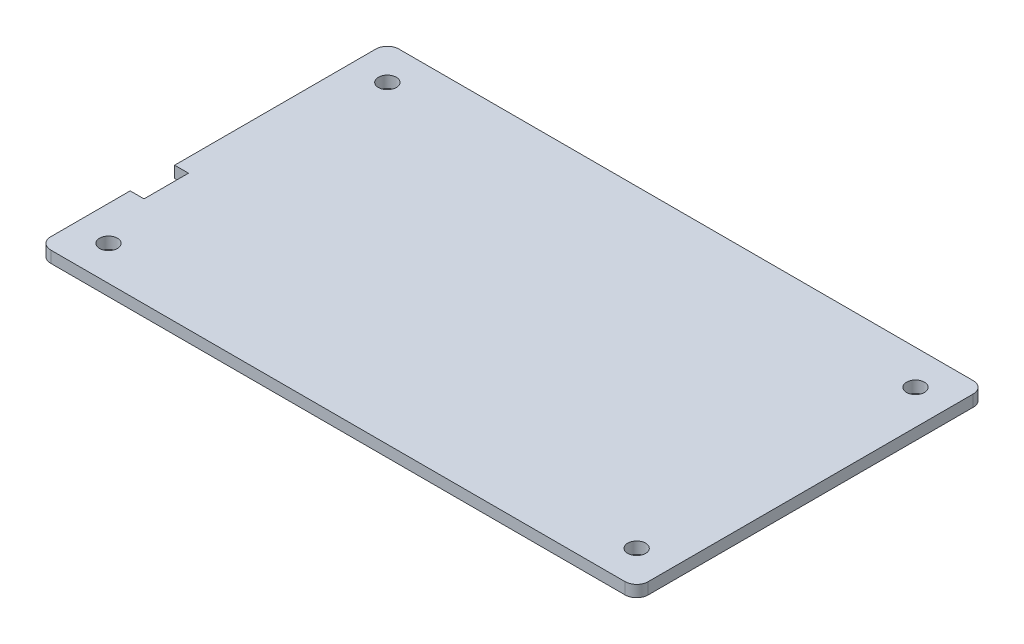
ISO-10303-21;
HEADER;
FILE_DESCRIPTION(('STEP AP214'),'2;1');
FILE_NAME('part.step','',(''),(''),'','','');
FILE_SCHEMA(('AUTOMOTIVE_DESIGN { 1 0 10303 214 1 1 1 1 }'));
ENDSEC;
DATA;
#1=APPLICATION_CONTEXT('core data for automotive mechanical design processes');
#2=APPLICATION_PROTOCOL_DEFINITION('international standard','automotive_design',2000,#1);
#3=PRODUCT_CONTEXT('',#1,'mechanical');
#4=PRODUCT('Part','Part','',(#3));
#5=PRODUCT_RELATED_PRODUCT_CATEGORY('part','',(#4));
#6=PRODUCT_DEFINITION_FORMATION('','',#4);
#7=PRODUCT_DEFINITION_CONTEXT('part definition',#1,'design');
#8=PRODUCT_DEFINITION('design','',#6,#7);
#9=PRODUCT_DEFINITION_SHAPE('','',#8);
#10=(LENGTH_UNIT() NAMED_UNIT(*) SI_UNIT(.MILLI.,.METRE.));
#11=(NAMED_UNIT(*) PLANE_ANGLE_UNIT() SI_UNIT($,.RADIAN.));
#12=(NAMED_UNIT(*) SI_UNIT($,.STERADIAN.) SOLID_ANGLE_UNIT());
#13=UNCERTAINTY_MEASURE_WITH_UNIT(LENGTH_MEASURE(1.E-05),#10,'distance_accuracy_value','');
#14=(GEOMETRIC_REPRESENTATION_CONTEXT(3) GLOBAL_UNCERTAINTY_ASSIGNED_CONTEXT((#13)) GLOBAL_UNIT_ASSIGNED_CONTEXT((#10,
#11,#12)) REPRESENTATION_CONTEXT('',''));
#15=CARTESIAN_POINT('',(0.,0.,0.));
#16=DIRECTION('',(0.,0.,1.));
#17=DIRECTION('',(1.,0.,0.));
#18=AXIS2_PLACEMENT_3D('',#15,#16,#17);
#19=CARTESIAN_POINT('',(97.46,2.,0.));
#20=DIRECTION('',(-1.,0.,0.));
#21=DIRECTION('',(0.,0.,1.));
#22=AXIS2_PLACEMENT_3D('',#19,#20,#21);
#23=PLANE('',#22);
#24=DIRECTION('',(0.,0.,-1.));
#25=VECTOR('',#24,1.);
#26=CARTESIAN_POINT('',(97.46,0.,0.));
#27=LINE('',#26,#25);
#28=CARTESIAN_POINT('',(97.46,0.,3.99999999999999));
#29=VERTEX_POINT('',#28);
#30=CARTESIAN_POINT('',(97.46,0.,-52.29));
#31=VERTEX_POINT('',#30);
#32=EDGE_CURVE('E169',#29,#31,#27,.T.);
#33=ORIENTED_EDGE('',*,*,#32,.T.);
#34=DIRECTION('',(0.,-1.,0.));
#35=VECTOR('',#34,1.);
#36=CARTESIAN_POINT('',(97.46,2.,-52.29));
#37=LINE('',#36,#35);
#38=CARTESIAN_POINT('',(97.46,2.,-52.29));
#39=VERTEX_POINT('',#38);
#40=EDGE_CURVE('E11',#39,#31,#37,.T.);
#41=ORIENTED_EDGE('',*,*,#40,.F.);
#42=DIRECTION('',(0.,0.,-1.));
#43=VECTOR('',#42,1.);
#44=CARTESIAN_POINT('',(97.46,2.,0.));
#45=LINE('',#44,#43);
#46=CARTESIAN_POINT('',(97.46,2.,3.99999999999999));
#47=VERTEX_POINT('',#46);
#48=EDGE_CURVE('E204',#47,#39,#45,.T.);
#49=ORIENTED_EDGE('',*,*,#48,.F.);
#50=DIRECTION('',(0.,-1.,0.));
#51=VECTOR('',#50,1.);
#52=CARTESIAN_POINT('',(97.46,2.,3.99999999999999));
#53=LINE('',#52,#51);
#54=EDGE_CURVE('E168',#47,#29,#53,.T.);
#55=ORIENTED_EDGE('',*,*,#54,.T.);
#56=EDGE_LOOP('',(#33,#41,#49,#55));
#57=FACE_BOUND('',#56,.T.);
#58=ADVANCED_FACE('F35',(#57),#23,.F.);
#59=CARTESIAN_POINT('',(95.46,2.,-52.29));
#60=DIRECTION('',(0.,-1.,0.));
#61=DIRECTION('',(0.,0.,-1.));
#62=AXIS2_PLACEMENT_3D('',#59,#60,#61);
#63=CYLINDRICAL_SURFACE('',#62,2.);
#64=CARTESIAN_POINT('',(95.46,0.,-52.29));
#65=DIRECTION('',(0.,1.,0.));
#66=DIRECTION('',(0.,0.,1.));
#67=AXIS2_PLACEMENT_3D('',#64,#65,#66);
#68=CIRCLE('',#67,2.);
#69=CARTESIAN_POINT('',(95.46,0.,-54.29));
#70=VERTEX_POINT('',#69);
#71=EDGE_CURVE('E172',#31,#70,#68,.T.);
#72=ORIENTED_EDGE('',*,*,#71,.T.);
#73=DIRECTION('',(0.,-1.,0.));
#74=VECTOR('',#73,1.);
#75=CARTESIAN_POINT('',(95.46,2.,-54.29));
#76=LINE('',#75,#74);
#77=CARTESIAN_POINT('',(95.46,2.,-54.29));
#78=VERTEX_POINT('',#77);
#79=EDGE_CURVE('E43',#78,#70,#76,.T.);
#80=ORIENTED_EDGE('',*,*,#79,.F.);
#81=CARTESIAN_POINT('',(95.46,2.,-52.29));
#82=DIRECTION('',(0.,1.,0.));
#83=DIRECTION('',(0.,0.,1.));
#84=AXIS2_PLACEMENT_3D('',#81,#82,#83);
#85=CIRCLE('',#84,2.);
#86=EDGE_CURVE('E106',#39,#78,#85,.T.);
#87=ORIENTED_EDGE('',*,*,#86,.F.);
#88=ORIENTED_EDGE('',*,*,#40,.T.);
#89=EDGE_LOOP('',(#72,#80,#87,#88));
#90=FACE_BOUND('',#89,.T.);
#91=ADVANCED_FACE('F279',(#90),#63,.T.);
#92=CARTESIAN_POINT('',(0.,2.,-54.29));
#93=DIRECTION('',(0.,0.,1.));
#94=DIRECTION('',(1.,0.,0.));
#95=AXIS2_PLACEMENT_3D('',#92,#93,#94);
#96=PLANE('',#95);
#97=DIRECTION('',(-1.,0.,0.));
#98=VECTOR('',#97,1.);
#99=CARTESIAN_POINT('',(0.,0.,-54.29));
#100=LINE('',#99,#98);
#101=CARTESIAN_POINT('',(-4.,0.,-54.29));
#102=VERTEX_POINT('',#101);
#103=EDGE_CURVE('E174',#70,#102,#100,.T.);
#104=ORIENTED_EDGE('',*,*,#103,.T.);
#105=DIRECTION('',(0.,-1.,0.));
#106=VECTOR('',#105,1.);
#107=CARTESIAN_POINT('',(-4.,2.,-54.29));
#108=LINE('',#107,#106);
#109=CARTESIAN_POINT('',(-4.,2.,-54.29));
#110=VERTEX_POINT('',#109);
#111=EDGE_CURVE('E221',#110,#102,#108,.T.);
#112=ORIENTED_EDGE('',*,*,#111,.F.);
#113=DIRECTION('',(-1.,0.,0.));
#114=VECTOR('',#113,1.);
#115=CARTESIAN_POINT('',(0.,2.,-54.29));
#116=LINE('',#115,#114);
#117=EDGE_CURVE('E229',#78,#110,#116,.T.);
#118=ORIENTED_EDGE('',*,*,#117,.F.);
#119=ORIENTED_EDGE('',*,*,#79,.T.);
#120=EDGE_LOOP('',(#104,#112,#118,#119));
#121=FACE_BOUND('',#120,.T.);
#122=ADVANCED_FACE('F227',(#121),#96,.F.);
#123=CARTESIAN_POINT('',(-4.,2.,-52.29));
#124=DIRECTION('',(0.,-1.,0.));
#125=DIRECTION('',(0.,0.,-1.));
#126=AXIS2_PLACEMENT_3D('',#123,#124,#125);
#127=CYLINDRICAL_SURFACE('',#126,2.);
#128=CARTESIAN_POINT('',(-4.,0.,-52.29));
#129=DIRECTION('',(0.,1.,0.));
#130=DIRECTION('',(0.,0.,1.));
#131=AXIS2_PLACEMENT_3D('',#128,#129,#130);
#132=CIRCLE('',#131,2.);
#133=CARTESIAN_POINT('',(-6.,0.,-52.29));
#134=VERTEX_POINT('',#133);
#135=EDGE_CURVE('E176',#102,#134,#132,.T.);
#136=ORIENTED_EDGE('',*,*,#135,.T.);
#137=DIRECTION('',(0.,-1.,0.));
#138=VECTOR('',#137,1.);
#139=CARTESIAN_POINT('',(-6.,2.,-52.29));
#140=LINE('',#139,#138);
#141=CARTESIAN_POINT('',(-6.,2.,-52.29));
#142=VERTEX_POINT('',#141);
#143=EDGE_CURVE('E218',#142,#134,#140,.T.);
#144=ORIENTED_EDGE('',*,*,#143,.F.);
#145=CARTESIAN_POINT('',(-4.,2.,-52.29));
#146=DIRECTION('',(0.,1.,0.));
#147=DIRECTION('',(0.,0.,1.));
#148=AXIS2_PLACEMENT_3D('',#145,#146,#147);
#149=CIRCLE('',#148,2.);
#150=EDGE_CURVE('E248',#110,#142,#149,.T.);
#151=ORIENTED_EDGE('',*,*,#150,.F.);
#152=ORIENTED_EDGE('',*,*,#111,.T.);
#153=EDGE_LOOP('',(#136,#144,#151,#152));
#154=FACE_BOUND('',#153,.T.);
#155=ADVANCED_FACE('F239',(#154),#127,.T.);
#156=CARTESIAN_POINT('',(-6.,2.,0.));
#157=DIRECTION('',(1.,0.,0.));
#158=DIRECTION('',(0.,0.,-1.));
#159=AXIS2_PLACEMENT_3D('',#156,#157,#158);
#160=PLANE('',#159);
#161=DIRECTION('',(0.,0.,1.));
#162=VECTOR('',#161,1.);
#163=CARTESIAN_POINT('',(-6.,0.,0.));
#164=LINE('',#163,#162);
#165=CARTESIAN_POINT('',(-6.,0.,-17.45));
#166=VERTEX_POINT('',#165);
#167=EDGE_CURVE('E178',#134,#166,#164,.T.);
#168=ORIENTED_EDGE('',*,*,#167,.T.);
#169=DIRECTION('',(0.,-1.,0.));
#170=VECTOR('',#169,1.);
#171=CARTESIAN_POINT('',(-6.,2.,-17.45));
#172=LINE('',#171,#170);
#173=CARTESIAN_POINT('',(-6.,2.,-17.45));
#174=VERTEX_POINT('',#173);
#175=EDGE_CURVE('E215',#174,#166,#172,.T.);
#176=ORIENTED_EDGE('',*,*,#175,.F.);
#177=DIRECTION('',(0.,0.,1.));
#178=VECTOR('',#177,1.);
#179=CARTESIAN_POINT('',(-6.,2.,0.));
#180=LINE('',#179,#178);
#181=EDGE_CURVE('E245',#142,#174,#180,.T.);
#182=ORIENTED_EDGE('',*,*,#181,.F.);
#183=ORIENTED_EDGE('',*,*,#143,.T.);
#184=EDGE_LOOP('',(#168,#176,#182,#183));
#185=FACE_BOUND('',#184,.T.);
#186=ADVANCED_FACE('F243',(#185),#160,.F.);
#187=CARTESIAN_POINT('',(0.,2.,-17.45));
#188=DIRECTION('',(0.,0.,-1.));
#189=DIRECTION('',(-1.,0.,0.));
#190=AXIS2_PLACEMENT_3D('',#187,#188,#189);
#191=PLANE('',#190);
#192=DIRECTION('',(1.,0.,0.));
#193=VECTOR('',#192,1.);
#194=CARTESIAN_POINT('',(0.,0.,-17.45));
#195=LINE('',#194,#193);
#196=CARTESIAN_POINT('',(-3.6,0.,-17.45));
#197=VERTEX_POINT('',#196);
#198=EDGE_CURVE('E180',#166,#197,#195,.T.);
#199=ORIENTED_EDGE('',*,*,#198,.T.);
#200=DIRECTION('',(0.,-1.,0.));
#201=VECTOR('',#200,1.);
#202=CARTESIAN_POINT('',(-3.6,2.,-17.45));
#203=LINE('',#202,#201);
#204=CARTESIAN_POINT('',(-3.6,2.,-17.45));
#205=VERTEX_POINT('',#204);
#206=EDGE_CURVE('E212',#205,#197,#203,.T.);
#207=ORIENTED_EDGE('',*,*,#206,.F.);
#208=DIRECTION('',(1.,0.,0.));
#209=VECTOR('',#208,1.);
#210=CARTESIAN_POINT('',(0.,2.,-17.45));
#211=LINE('',#210,#209);
#212=EDGE_CURVE('E247',#174,#205,#211,.T.);
#213=ORIENTED_EDGE('',*,*,#212,.F.);
#214=ORIENTED_EDGE('',*,*,#175,.T.);
#215=EDGE_LOOP('',(#199,#207,#213,#214));
#216=FACE_BOUND('',#215,.T.);
#217=ADVANCED_FACE('F277',(#216),#191,.F.);
#218=CARTESIAN_POINT('',(-3.59999999999999,2.,0.));
#219=DIRECTION('',(1.,0.,0.));
#220=DIRECTION('',(0.,0.,-1.));
#221=AXIS2_PLACEMENT_3D('',#218,#219,#220);
#222=PLANE('',#221);
#223=DIRECTION('',(0.,0.,1.));
#224=VECTOR('',#223,1.);
#225=CARTESIAN_POINT('',(-3.59999999999999,0.,0.));
#226=LINE('',#225,#224);
#227=CARTESIAN_POINT('',(-3.6,0.,-9.75));
#228=VERTEX_POINT('',#227);
#229=EDGE_CURVE('E183',#197,#228,#226,.T.);
#230=ORIENTED_EDGE('',*,*,#229,.T.);
#231=DIRECTION('',(0.,-1.,0.));
#232=VECTOR('',#231,1.);
#233=CARTESIAN_POINT('',(-3.6,2.,-9.75));
#234=LINE('',#233,#232);
#235=CARTESIAN_POINT('',(-3.6,2.,-9.75));
#236=VERTEX_POINT('',#235);
#237=EDGE_CURVE('E210',#236,#228,#234,.T.);
#238=ORIENTED_EDGE('',*,*,#237,.F.);
#239=DIRECTION('',(0.,0.,1.));
#240=VECTOR('',#239,1.);
#241=CARTESIAN_POINT('',(-3.59999999999999,2.,0.));
#242=LINE('',#241,#240);
#243=EDGE_CURVE('E250',#205,#236,#242,.T.);
#244=ORIENTED_EDGE('',*,*,#243,.F.);
#245=ORIENTED_EDGE('',*,*,#206,.T.);
#246=EDGE_LOOP('',(#230,#238,#244,#245));
#247=FACE_BOUND('',#246,.T.);
#248=ADVANCED_FACE('F261',(#247),#222,.F.);
#249=CARTESIAN_POINT('',(0.,2.,-9.74999999999999));
#250=DIRECTION('',(0.,0.,-1.));
#251=DIRECTION('',(-1.,0.,0.));
#252=AXIS2_PLACEMENT_3D('',#249,#250,#251);
#253=PLANE('',#252);
#254=DIRECTION('',(1.,0.,0.));
#255=VECTOR('',#254,1.);
#256=CARTESIAN_POINT('',(0.,0.,-9.74999999999999));
#257=LINE('',#256,#255);
#258=CARTESIAN_POINT('',(-6.,0.,-9.75000000000001));
#259=VERTEX_POINT('',#258);
#260=EDGE_CURVE('E186',#259,#228,#257,.T.);
#261=ORIENTED_EDGE('',*,*,#260,.F.);
#262=DIRECTION('',(0.,-1.,0.));
#263=VECTOR('',#262,1.);
#264=CARTESIAN_POINT('',(-6.,2.,-9.75000000000001));
#265=LINE('',#264,#263);
#266=CARTESIAN_POINT('',(-6.,2.,-9.75000000000001));
#267=VERTEX_POINT('',#266);
#268=EDGE_CURVE('E208',#267,#259,#265,.T.);
#269=ORIENTED_EDGE('',*,*,#268,.F.);
#270=DIRECTION('',(1.,0.,0.));
#271=VECTOR('',#270,1.);
#272=CARTESIAN_POINT('',(0.,2.,-9.74999999999999));
#273=LINE('',#272,#271);
#274=EDGE_CURVE('E253',#267,#236,#273,.T.);
#275=ORIENTED_EDGE('',*,*,#274,.T.);
#276=ORIENTED_EDGE('',*,*,#237,.T.);
#277=EDGE_LOOP('',(#261,#269,#275,#276));
#278=FACE_BOUND('',#277,.T.);
#279=ADVANCED_FACE('F264',(#278),#253,.T.);
#280=CARTESIAN_POINT('',(-6.,0.,4.));
#281=VERTEX_POINT('',#280);
#282=EDGE_CURVE('E181',#259,#281,#164,.T.);
#283=ORIENTED_EDGE('',*,*,#282,.T.);
#284=DIRECTION('',(0.,-1.,0.));
#285=VECTOR('',#284,1.);
#286=CARTESIAN_POINT('',(-6.,2.,4.));
#287=LINE('',#286,#285);
#288=CARTESIAN_POINT('',(-6.,2.,4.));
#289=VERTEX_POINT('',#288);
#290=EDGE_CURVE('E148',#289,#281,#287,.T.);
#291=ORIENTED_EDGE('',*,*,#290,.F.);
#292=EDGE_CURVE('E139',#267,#289,#180,.T.);
#293=ORIENTED_EDGE('',*,*,#292,.F.);
#294=ORIENTED_EDGE('',*,*,#268,.T.);
#295=EDGE_LOOP('',(#283,#291,#293,#294));
#296=FACE_BOUND('',#295,.T.);
#297=ADVANCED_FACE('F267',(#296),#160,.F.);
#298=CARTESIAN_POINT('',(-4.,2.,4.));
#299=DIRECTION('',(0.,-1.,0.));
#300=DIRECTION('',(0.,0.,-1.));
#301=AXIS2_PLACEMENT_3D('',#298,#299,#300);
#302=CYLINDRICAL_SURFACE('',#301,2.);
#303=CARTESIAN_POINT('',(-4.,0.,4.));
#304=DIRECTION('',(0.,1.,0.));
#305=DIRECTION('',(0.,0.,1.));
#306=AXIS2_PLACEMENT_3D('',#303,#304,#305);
#307=CIRCLE('',#306,2.);
#308=CARTESIAN_POINT('',(-4.,0.,6.));
#309=VERTEX_POINT('',#308);
#310=EDGE_CURVE('E147',#281,#309,#307,.T.);
#311=ORIENTED_EDGE('',*,*,#310,.T.);
#312=DIRECTION('',(0.,-1.,0.));
#313=VECTOR('',#312,1.);
#314=CARTESIAN_POINT('',(-4.,2.,6.));
#315=LINE('',#314,#313);
#316=CARTESIAN_POINT('',(-4.,2.,6.));
#317=VERTEX_POINT('',#316);
#318=EDGE_CURVE('E144',#317,#309,#315,.T.);
#319=ORIENTED_EDGE('',*,*,#318,.F.);
#320=CARTESIAN_POINT('',(-4.,2.,4.));
#321=DIRECTION('',(0.,1.,0.));
#322=DIRECTION('',(0.,0.,1.));
#323=AXIS2_PLACEMENT_3D('',#320,#321,#322);
#324=CIRCLE('',#323,2.);
#325=EDGE_CURVE('E131',#289,#317,#324,.T.);
#326=ORIENTED_EDGE('',*,*,#325,.F.);
#327=ORIENTED_EDGE('',*,*,#290,.T.);
#328=EDGE_LOOP('',(#311,#319,#326,#327));
#329=FACE_BOUND('',#328,.T.);
#330=ADVANCED_FACE('F145',(#329),#302,.T.);
#331=CARTESIAN_POINT('',(0.,2.,6.));
#332=DIRECTION('',(0.,0.,-1.));
#333=DIRECTION('',(-1.,0.,0.));
#334=AXIS2_PLACEMENT_3D('',#331,#332,#333);
#335=PLANE('',#334);
#336=DIRECTION('',(1.,0.,0.));
#337=VECTOR('',#336,1.);
#338=CARTESIAN_POINT('',(0.,0.,6.));
#339=LINE('',#338,#337);
#340=CARTESIAN_POINT('',(95.46,0.,5.99999999999998));
#341=VERTEX_POINT('',#340);
#342=EDGE_CURVE('E92',#309,#341,#339,.T.);
#343=ORIENTED_EDGE('',*,*,#342,.T.);
#344=DIRECTION('',(0.,-1.,0.));
#345=VECTOR('',#344,1.);
#346=CARTESIAN_POINT('',(95.46,2.,5.99999999999998));
#347=LINE('',#346,#345);
#348=CARTESIAN_POINT('',(95.46,2.,5.99999999999998));
#349=VERTEX_POINT('',#348);
#350=EDGE_CURVE('E149',#349,#341,#347,.T.);
#351=ORIENTED_EDGE('',*,*,#350,.F.);
#352=DIRECTION('',(1.,0.,0.));
#353=VECTOR('',#352,1.);
#354=CARTESIAN_POINT('',(0.,2.,6.));
#355=LINE('',#354,#353);
#356=EDGE_CURVE('E136',#317,#349,#355,.T.);
#357=ORIENTED_EDGE('',*,*,#356,.F.);
#358=ORIENTED_EDGE('',*,*,#318,.T.);
#359=EDGE_LOOP('',(#343,#351,#357,#358));
#360=FACE_BOUND('',#359,.T.);
#361=ADVANCED_FACE('F151',(#360),#335,.F.);
#362=CARTESIAN_POINT('',(91.46,2.,0.));
#363=DIRECTION('',(0.,-1.,0.));
#364=DIRECTION('',(0.,0.,-1.));
#365=AXIS2_PLACEMENT_3D('',#362,#363,#364);
#366=CYLINDRICAL_SURFACE('',#365,1.54999999999999);
#367=CARTESIAN_POINT('',(91.46,2.,0.));
#368=DIRECTION('',(0.,1.,0.));
#369=DIRECTION('',(0.,0.,1.));
#370=AXIS2_PLACEMENT_3D('',#367,#368,#369);
#371=CIRCLE('',#370,1.54999999999999);
#372=CARTESIAN_POINT('',(91.46,2.,1.54999999999999));
#373=VERTEX_POINT('',#372);
#374=EDGE_CURVE('E162',#373,#373,#371,.T.);
#375=ORIENTED_EDGE('',*,*,#374,.T.);
#376=EDGE_LOOP('',(#375));
#377=FACE_BOUND('',#376,.T.);
#378=CARTESIAN_POINT('',(91.46,0.,0.));
#379=DIRECTION('',(0.,1.,0.));
#380=DIRECTION('',(0.,0.,1.));
#381=AXIS2_PLACEMENT_3D('',#378,#379,#380);
#382=CIRCLE('',#381,1.54999999999999);
#383=CARTESIAN_POINT('',(91.46,0.,1.54999999999999));
#384=VERTEX_POINT('',#383);
#385=EDGE_CURVE('E198',#384,#384,#382,.T.);
#386=ORIENTED_EDGE('',*,*,#385,.F.);
#387=EDGE_LOOP('',(#386));
#388=FACE_BOUND('',#387,.T.);
#389=ADVANCED_FACE('F303',(#377,#388),#366,.F.);
#390=CARTESIAN_POINT('',(91.4599999999998,2.,-48.29));
#391=DIRECTION('',(0.,-1.,0.));
#392=DIRECTION('',(0.,0.,-1.));
#393=AXIS2_PLACEMENT_3D('',#390,#391,#392);
#394=CYLINDRICAL_SURFACE('',#393,1.55);
#395=CARTESIAN_POINT('',(91.4599999999998,2.,-48.29));
#396=DIRECTION('',(0.,1.,0.));
#397=DIRECTION('',(0.,0.,1.));
#398=AXIS2_PLACEMENT_3D('',#395,#396,#397);
#399=CIRCLE('',#398,1.55);
#400=CARTESIAN_POINT('',(91.4599999999998,2.,-46.74));
#401=VERTEX_POINT('',#400);
#402=EDGE_CURVE('E159',#401,#401,#399,.T.);
#403=ORIENTED_EDGE('',*,*,#402,.T.);
#404=EDGE_LOOP('',(#403));
#405=FACE_BOUND('',#404,.T.);
#406=CARTESIAN_POINT('',(91.4599999999998,0.,-48.29));
#407=DIRECTION('',(0.,1.,0.));
#408=DIRECTION('',(0.,0.,1.));
#409=AXIS2_PLACEMENT_3D('',#406,#407,#408);
#410=CIRCLE('',#409,1.55);
#411=CARTESIAN_POINT('',(91.4599999999998,0.,-46.74));
#412=VERTEX_POINT('',#411);
#413=EDGE_CURVE('E195',#412,#412,#410,.T.);
#414=ORIENTED_EDGE('',*,*,#413,.F.);
#415=EDGE_LOOP('',(#414));
#416=FACE_BOUND('',#415,.T.);
#417=ADVANCED_FACE('F297',(#405,#416),#394,.F.);
#418=CARTESIAN_POINT('',(-1.65646724156194E-13,2.,-48.29));
#419=DIRECTION('',(0.,-1.,0.));
#420=DIRECTION('',(0.,0.,-1.));
#421=AXIS2_PLACEMENT_3D('',#418,#419,#420);
#422=CYLINDRICAL_SURFACE('',#421,1.55);
#423=CARTESIAN_POINT('',(-1.65646724156194E-13,2.,-48.29));
#424=DIRECTION('',(0.,1.,0.));
#425=DIRECTION('',(0.,0.,1.));
#426=AXIS2_PLACEMENT_3D('',#423,#424,#425);
#427=CIRCLE('',#426,1.55);
#428=CARTESIAN_POINT('',(-1.65646724156194E-13,2.,-46.74));
#429=VERTEX_POINT('',#428);
#430=EDGE_CURVE('E153',#429,#429,#427,.T.);
#431=ORIENTED_EDGE('',*,*,#430,.T.);
#432=EDGE_LOOP('',(#431));
#433=FACE_BOUND('',#432,.T.);
#434=CARTESIAN_POINT('',(-1.65646724156194E-13,0.,-48.29));
#435=DIRECTION('',(0.,1.,0.));
#436=DIRECTION('',(0.,0.,1.));
#437=AXIS2_PLACEMENT_3D('',#434,#435,#436);
#438=CIRCLE('',#437,1.55);
#439=CARTESIAN_POINT('',(-1.65646724156194E-13,0.,-46.74));
#440=VERTEX_POINT('',#439);
#441=EDGE_CURVE('E192',#440,#440,#438,.T.);
#442=ORIENTED_EDGE('',*,*,#441,.F.);
#443=EDGE_LOOP('',(#442));
#444=FACE_BOUND('',#443,.T.);
#445=ADVANCED_FACE('F289',(#433,#444),#422,.F.);
#446=CARTESIAN_POINT('',(95.46,2.,3.99999999999999));
#447=DIRECTION('',(0.,-1.,0.));
#448=DIRECTION('',(0.,0.,-1.));
#449=AXIS2_PLACEMENT_3D('',#446,#447,#448);
#450=CYLINDRICAL_SURFACE('',#449,2.);
#451=CARTESIAN_POINT('',(95.46,0.,3.99999999999999));
#452=DIRECTION('',(0.,1.,0.));
#453=DIRECTION('',(0.,0.,1.));
#454=AXIS2_PLACEMENT_3D('',#451,#452,#453);
#455=CIRCLE('',#454,2.);
#456=EDGE_CURVE('E98',#341,#29,#455,.T.);
#457=ORIENTED_EDGE('',*,*,#456,.T.);
#458=ORIENTED_EDGE('',*,*,#54,.F.);
#459=CARTESIAN_POINT('',(95.46,2.,3.99999999999999));
#460=DIRECTION('',(0.,1.,0.));
#461=DIRECTION('',(0.,0.,1.));
#462=AXIS2_PLACEMENT_3D('',#459,#460,#461);
#463=CIRCLE('',#462,2.);
#464=EDGE_CURVE('E51',#349,#47,#463,.T.);
#465=ORIENTED_EDGE('',*,*,#464,.F.);
#466=ORIENTED_EDGE('',*,*,#350,.T.);
#467=EDGE_LOOP('',(#457,#458,#465,#466));
#468=FACE_BOUND('',#467,.T.);
#469=ADVANCED_FACE('F286',(#468),#450,.T.);
#470=CARTESIAN_POINT('',(0.,2.,0.));
#471=DIRECTION('',(0.,-1.,0.));
#472=DIRECTION('',(0.,0.,-1.));
#473=AXIS2_PLACEMENT_3D('',#470,#471,#472);
#474=CYLINDRICAL_SURFACE('',#473,1.55);
#475=CARTESIAN_POINT('',(0.,2.,0.));
#476=DIRECTION('',(0.,1.,0.));
#477=DIRECTION('',(0.,0.,1.));
#478=AXIS2_PLACEMENT_3D('',#475,#476,#477);
#479=CIRCLE('',#478,1.55);
#480=CARTESIAN_POINT('',(0.,2.,1.55));
#481=VERTEX_POINT('',#480);
#482=EDGE_CURVE('E165',#481,#481,#479,.T.);
#483=ORIENTED_EDGE('',*,*,#482,.T.);
#484=EDGE_LOOP('',(#483));
#485=FACE_BOUND('',#484,.T.);
#486=CARTESIAN_POINT('',(0.,0.,0.));
#487=DIRECTION('',(0.,1.,0.));
#488=DIRECTION('',(0.,0.,1.));
#489=AXIS2_PLACEMENT_3D('',#486,#487,#488);
#490=CIRCLE('',#489,1.55);
#491=CARTESIAN_POINT('',(0.,0.,1.55));
#492=VERTEX_POINT('',#491);
#493=EDGE_CURVE('E201',#492,#492,#490,.T.);
#494=ORIENTED_EDGE('',*,*,#493,.F.);
#495=EDGE_LOOP('',(#494));
#496=FACE_BOUND('',#495,.T.);
#497=ADVANCED_FACE('F288',(#485,#496),#474,.F.);
#498=CARTESIAN_POINT('',(0.,2.,0.));
#499=DIRECTION('',(0.,1.,0.));
#500=DIRECTION('',(0.,0.,1.));
#501=AXIS2_PLACEMENT_3D('',#498,#499,#500);
#502=PLANE('',#501);
#503=ORIENTED_EDGE('',*,*,#48,.T.);
#504=ORIENTED_EDGE('',*,*,#86,.T.);
#505=ORIENTED_EDGE('',*,*,#117,.T.);
#506=ORIENTED_EDGE('',*,*,#150,.T.);
#507=ORIENTED_EDGE('',*,*,#181,.T.);
#508=ORIENTED_EDGE('',*,*,#212,.T.);
#509=ORIENTED_EDGE('',*,*,#243,.T.);
#510=ORIENTED_EDGE('',*,*,#274,.F.);
#511=ORIENTED_EDGE('',*,*,#292,.T.);
#512=ORIENTED_EDGE('',*,*,#325,.T.);
#513=ORIENTED_EDGE('',*,*,#356,.T.);
#514=ORIENTED_EDGE('',*,*,#464,.T.);
#515=EDGE_LOOP('',(#503,#504,#505,#506,#507,#508,#509,#510,#511,#512,#513,#514));
#516=FACE_BOUND('',#515,.T.);
#517=ORIENTED_EDGE('',*,*,#430,.F.);
#518=EDGE_LOOP('',(#517));
#519=FACE_BOUND('',#518,.T.);
#520=ORIENTED_EDGE('',*,*,#402,.F.);
#521=EDGE_LOOP('',(#520));
#522=FACE_BOUND('',#521,.T.);
#523=ORIENTED_EDGE('',*,*,#374,.F.);
#524=EDGE_LOOP('',(#523));
#525=FACE_BOUND('',#524,.T.);
#526=ORIENTED_EDGE('',*,*,#482,.F.);
#527=EDGE_LOOP('',(#526));
#528=FACE_BOUND('',#527,.T.);
#529=ADVANCED_FACE('F133',(#516,#519,#522,#525,#528),#502,.T.);
#530=CARTESIAN_POINT('',(0.,0.,0.));
#531=DIRECTION('',(0.,1.,0.));
#532=DIRECTION('',(0.,0.,1.));
#533=AXIS2_PLACEMENT_3D('',#530,#531,#532);
#534=PLANE('',#533);
#535=ORIENTED_EDGE('',*,*,#32,.F.);
#536=ORIENTED_EDGE('',*,*,#456,.F.);
#537=ORIENTED_EDGE('',*,*,#342,.F.);
#538=ORIENTED_EDGE('',*,*,#310,.F.);
#539=ORIENTED_EDGE('',*,*,#282,.F.);
#540=ORIENTED_EDGE('',*,*,#260,.T.);
#541=ORIENTED_EDGE('',*,*,#229,.F.);
#542=ORIENTED_EDGE('',*,*,#198,.F.);
#543=ORIENTED_EDGE('',*,*,#167,.F.);
#544=ORIENTED_EDGE('',*,*,#135,.F.);
#545=ORIENTED_EDGE('',*,*,#103,.F.);
#546=ORIENTED_EDGE('',*,*,#71,.F.);
#547=EDGE_LOOP('',(#535,#536,#537,#538,#539,#540,#541,#542,#543,#544,#545,#546));
#548=FACE_BOUND('',#547,.T.);
#549=ORIENTED_EDGE('',*,*,#441,.T.);
#550=EDGE_LOOP('',(#549));
#551=FACE_BOUND('',#550,.T.);
#552=ORIENTED_EDGE('',*,*,#413,.T.);
#553=EDGE_LOOP('',(#552));
#554=FACE_BOUND('',#553,.T.);
#555=ORIENTED_EDGE('',*,*,#385,.T.);
#556=EDGE_LOOP('',(#555));
#557=FACE_BOUND('',#556,.T.);
#558=ORIENTED_EDGE('',*,*,#493,.T.);
#559=EDGE_LOOP('',(#558));
#560=FACE_BOUND('',#559,.T.);
#561=ADVANCED_FACE('F233',(#548,#551,#554,#557,#560),#534,.F.);
#562=CLOSED_SHELL('',(#58,#91,#122,#155,#186,#217,#248,#279,#297,#330,#361,#389,#417,#445,#469,
#497,#529,#561));
#563=MANIFOLD_SOLID_BREP('B2',#562);
#564=ADVANCED_BREP_SHAPE_REPRESENTATION('',(#18,#563),#14);
#565=SHAPE_DEFINITION_REPRESENTATION(#9,#564);
ENDSEC;
END-ISO-10303-21;
